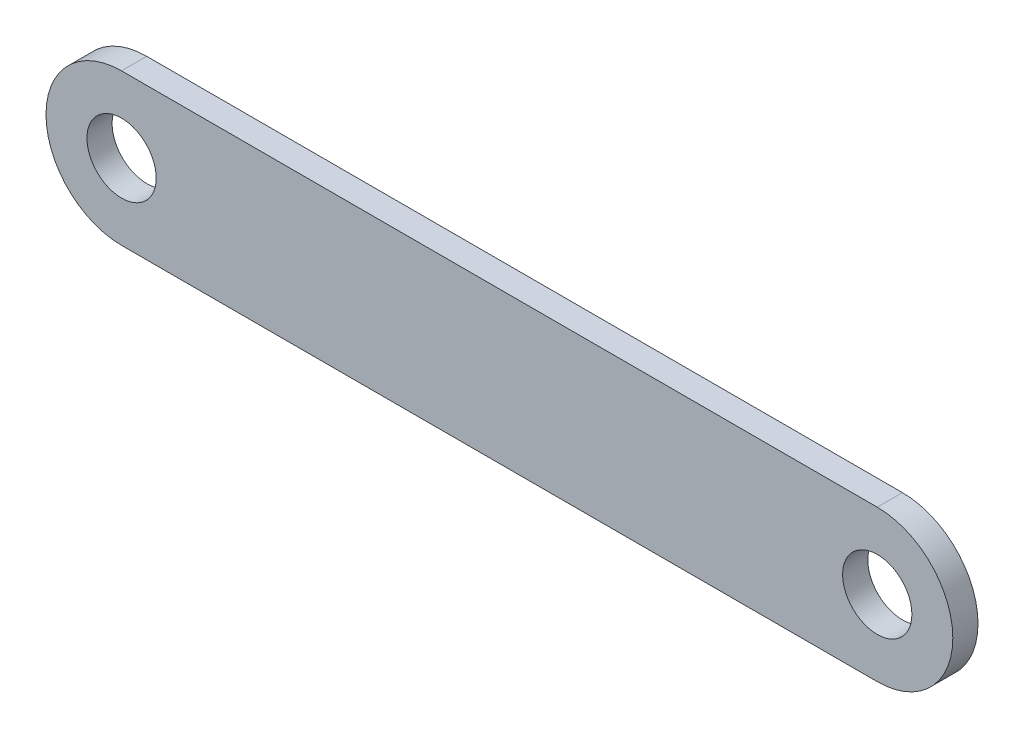
ISO-10303-21;
HEADER;
FILE_DESCRIPTION(('STEP AP214'),'2;1');
FILE_NAME('part.step','',(''),(''),'','','');
FILE_SCHEMA(('AUTOMOTIVE_DESIGN { 1 0 10303 214 1 1 1 1 }'));
ENDSEC;
DATA;
#1=APPLICATION_CONTEXT('core data for automotive mechanical design processes');
#2=APPLICATION_PROTOCOL_DEFINITION('international standard','automotive_design',2000,#1);
#3=PRODUCT_CONTEXT('',#1,'mechanical');
#4=PRODUCT('Part','Part','',(#3));
#5=PRODUCT_RELATED_PRODUCT_CATEGORY('part','',(#4));
#6=PRODUCT_DEFINITION_FORMATION('','',#4);
#7=PRODUCT_DEFINITION_CONTEXT('part definition',#1,'design');
#8=PRODUCT_DEFINITION('design','',#6,#7);
#9=PRODUCT_DEFINITION_SHAPE('','',#8);
#10=(LENGTH_UNIT() NAMED_UNIT(*) SI_UNIT(.MILLI.,.METRE.));
#11=(NAMED_UNIT(*) PLANE_ANGLE_UNIT() SI_UNIT($,.RADIAN.));
#12=(NAMED_UNIT(*) SI_UNIT($,.STERADIAN.) SOLID_ANGLE_UNIT());
#13=UNCERTAINTY_MEASURE_WITH_UNIT(LENGTH_MEASURE(1.E-05),#10,'distance_accuracy_value','');
#14=(GEOMETRIC_REPRESENTATION_CONTEXT(3) GLOBAL_UNCERTAINTY_ASSIGNED_CONTEXT((#13)) GLOBAL_UNIT_ASSIGNED_CONTEXT((#10,
#11,#12)) REPRESENTATION_CONTEXT('',''));
#15=CARTESIAN_POINT('',(0.,0.,0.));
#16=DIRECTION('',(0.,0.,1.));
#17=DIRECTION('',(1.,0.,0.));
#18=AXIS2_PLACEMENT_3D('',#15,#16,#17);
#19=CARTESIAN_POINT('',(-30.,0.,2.));
#20=DIRECTION('',(0.,0.,1.));
#21=DIRECTION('',(1.,0.,0.));
#22=AXIS2_PLACEMENT_3D('',#19,#20,#21);
#23=PLANE('',#22);
#24=CARTESIAN_POINT('',(30.,0.,2.));
#25=DIRECTION('',(0.,0.,1.));
#26=DIRECTION('',(1.,0.,0.));
#27=AXIS2_PLACEMENT_3D('',#24,#25,#26);
#28=CIRCLE('',#27,2.75);
#29=CARTESIAN_POINT('',(32.75,0.,2.));
#30=VERTEX_POINT('',#29);
#31=EDGE_CURVE('E100',#30,#30,#28,.T.);
#32=ORIENTED_EDGE('',*,*,#31,.F.);
#33=EDGE_LOOP('',(#32));
#34=FACE_BOUND('',#33,.T.);
#35=CARTESIAN_POINT('',(-30.,0.,2.));
#36=DIRECTION('',(0.,0.,1.));
#37=DIRECTION('',(1.,0.,0.));
#38=AXIS2_PLACEMENT_3D('',#35,#36,#37);
#39=CIRCLE('',#38,6.);
#40=CARTESIAN_POINT('',(-30.,6.,2.));
#41=VERTEX_POINT('',#40);
#42=CARTESIAN_POINT('',(-30.,-6.,2.));
#43=VERTEX_POINT('',#42);
#44=EDGE_CURVE('E85',#41,#43,#39,.T.);
#45=ORIENTED_EDGE('',*,*,#44,.T.);
#46=DIRECTION('',(1.,0.,0.));
#47=VECTOR('',#46,1.);
#48=CARTESIAN_POINT('',(-30.,-6.,2.));
#49=LINE('',#48,#47);
#50=CARTESIAN_POINT('',(30.,-5.99999999999999,2.));
#51=VERTEX_POINT('',#50);
#52=EDGE_CURVE('E80',#43,#51,#49,.T.);
#53=ORIENTED_EDGE('',*,*,#52,.T.);
#54=CARTESIAN_POINT('',(30.,0.,2.));
#55=DIRECTION('',(0.,0.,1.));
#56=DIRECTION('',(1.,0.,0.));
#57=AXIS2_PLACEMENT_3D('',#54,#55,#56);
#58=CIRCLE('',#57,6.);
#59=CARTESIAN_POINT('',(30.,6.00000000000001,2.));
#60=VERTEX_POINT('',#59);
#61=EDGE_CURVE('E83',#51,#60,#58,.T.);
#62=ORIENTED_EDGE('',*,*,#61,.T.);
#63=DIRECTION('',(-1.,0.,0.));
#64=VECTOR('',#63,1.);
#65=CARTESIAN_POINT('',(-30.,6.,2.));
#66=LINE('',#65,#64);
#67=EDGE_CURVE('E50',#60,#41,#66,.T.);
#68=ORIENTED_EDGE('',*,*,#67,.T.);
#69=EDGE_LOOP('',(#45,#53,#62,#68));
#70=FACE_BOUND('',#69,.T.);
#71=CARTESIAN_POINT('',(-30.,0.,2.));
#72=DIRECTION('',(0.,0.,1.));
#73=DIRECTION('',(1.,0.,0.));
#74=AXIS2_PLACEMENT_3D('',#71,#72,#73);
#75=CIRCLE('',#74,2.75);
#76=CARTESIAN_POINT('',(-27.25,0.,2.));
#77=VERTEX_POINT('',#76);
#78=EDGE_CURVE('E115',#77,#77,#75,.T.);
#79=ORIENTED_EDGE('',*,*,#78,.F.);
#80=EDGE_LOOP('',(#79));
#81=FACE_BOUND('',#80,.T.);
#82=ADVANCED_FACE('F33',(#34,#70,#81),#23,.T.);
#83=CARTESIAN_POINT('',(-30.,0.,0.));
#84=DIRECTION('',(0.,0.,1.));
#85=DIRECTION('',(1.,0.,0.));
#86=AXIS2_PLACEMENT_3D('',#83,#84,#85);
#87=PLANE('',#86);
#88=CARTESIAN_POINT('',(-30.,0.,0.));
#89=DIRECTION('',(0.,0.,1.));
#90=DIRECTION('',(1.,0.,0.));
#91=AXIS2_PLACEMENT_3D('',#88,#89,#90);
#92=CIRCLE('',#91,6.);
#93=CARTESIAN_POINT('',(-30.,6.,0.));
#94=VERTEX_POINT('',#93);
#95=CARTESIAN_POINT('',(-30.,-6.,0.));
#96=VERTEX_POINT('',#95);
#97=EDGE_CURVE('E97',#94,#96,#92,.T.);
#98=ORIENTED_EDGE('',*,*,#97,.F.);
#99=DIRECTION('',(-1.,0.,0.));
#100=VECTOR('',#99,1.);
#101=CARTESIAN_POINT('',(-30.,6.,0.));
#102=LINE('',#101,#100);
#103=CARTESIAN_POINT('',(30.,6.00000000000001,0.));
#104=VERTEX_POINT('',#103);
#105=EDGE_CURVE('E73',#104,#94,#102,.T.);
#106=ORIENTED_EDGE('',*,*,#105,.F.);
#107=CARTESIAN_POINT('',(30.,0.,0.));
#108=DIRECTION('',(0.,0.,1.));
#109=DIRECTION('',(1.,0.,0.));
#110=AXIS2_PLACEMENT_3D('',#107,#108,#109);
#111=CIRCLE('',#110,6.);
#112=CARTESIAN_POINT('',(30.,-5.99999999999999,0.));
#113=VERTEX_POINT('',#112);
#114=EDGE_CURVE('E67',#113,#104,#111,.T.);
#115=ORIENTED_EDGE('',*,*,#114,.F.);
#116=DIRECTION('',(1.,0.,0.));
#117=VECTOR('',#116,1.);
#118=CARTESIAN_POINT('',(-30.,-6.,0.));
#119=LINE('',#118,#117);
#120=EDGE_CURVE('E89',#96,#113,#119,.T.);
#121=ORIENTED_EDGE('',*,*,#120,.F.);
#122=EDGE_LOOP('',(#98,#106,#115,#121));
#123=FACE_BOUND('',#122,.T.);
#124=CARTESIAN_POINT('',(30.,0.,0.));
#125=DIRECTION('',(0.,0.,1.));
#126=DIRECTION('',(1.,0.,0.));
#127=AXIS2_PLACEMENT_3D('',#124,#125,#126);
#128=CIRCLE('',#127,2.75);
#129=CARTESIAN_POINT('',(32.75,0.,0.));
#130=VERTEX_POINT('',#129);
#131=EDGE_CURVE('E112',#130,#130,#128,.T.);
#132=ORIENTED_EDGE('',*,*,#131,.T.);
#133=EDGE_LOOP('',(#132));
#134=FACE_BOUND('',#133,.T.);
#135=CARTESIAN_POINT('',(-30.,0.,0.));
#136=DIRECTION('',(0.,0.,1.));
#137=DIRECTION('',(1.,0.,0.));
#138=AXIS2_PLACEMENT_3D('',#135,#136,#137);
#139=CIRCLE('',#138,2.75);
#140=CARTESIAN_POINT('',(-27.25,0.,0.));
#141=VERTEX_POINT('',#140);
#142=EDGE_CURVE('E118',#141,#141,#139,.T.);
#143=ORIENTED_EDGE('',*,*,#142,.T.);
#144=EDGE_LOOP('',(#143));
#145=FACE_BOUND('',#144,.T.);
#146=ADVANCED_FACE('F108',(#123,#134,#145),#87,.F.);
#147=CARTESIAN_POINT('',(-30.,0.,2.));
#148=DIRECTION('',(0.,0.,-1.));
#149=DIRECTION('',(-1.,0.,0.));
#150=AXIS2_PLACEMENT_3D('',#147,#148,#149);
#151=CYLINDRICAL_SURFACE('',#150,6.);
#152=ORIENTED_EDGE('',*,*,#97,.T.);
#153=DIRECTION('',(0.,0.,-1.));
#154=VECTOR('',#153,1.);
#155=CARTESIAN_POINT('',(-30.,-6.,2.));
#156=LINE('',#155,#154);
#157=EDGE_CURVE('E11',#43,#96,#156,.T.);
#158=ORIENTED_EDGE('',*,*,#157,.F.);
#159=ORIENTED_EDGE('',*,*,#44,.F.);
#160=DIRECTION('',(0.,0.,-1.));
#161=VECTOR('',#160,1.);
#162=CARTESIAN_POINT('',(-30.,6.,2.));
#163=LINE('',#162,#161);
#164=EDGE_CURVE('E93',#41,#94,#163,.T.);
#165=ORIENTED_EDGE('',*,*,#164,.T.);
#166=EDGE_LOOP('',(#152,#158,#159,#165));
#167=FACE_BOUND('',#166,.T.);
#168=ADVANCED_FACE('F35',(#167),#151,.T.);
#169=CARTESIAN_POINT('',(-30.,-6.,2.));
#170=DIRECTION('',(0.,1.,0.));
#171=DIRECTION('',(-1.,0.,0.));
#172=AXIS2_PLACEMENT_3D('',#169,#170,#171);
#173=PLANE('',#172);
#174=ORIENTED_EDGE('',*,*,#120,.T.);
#175=DIRECTION('',(0.,0.,-1.));
#176=VECTOR('',#175,1.);
#177=CARTESIAN_POINT('',(30.,-5.99999999999999,2.));
#178=LINE('',#177,#176);
#179=EDGE_CURVE('E42',#51,#113,#178,.T.);
#180=ORIENTED_EDGE('',*,*,#179,.F.);
#181=ORIENTED_EDGE('',*,*,#52,.F.);
#182=ORIENTED_EDGE('',*,*,#157,.T.);
#183=EDGE_LOOP('',(#174,#180,#181,#182));
#184=FACE_BOUND('',#183,.T.);
#185=ADVANCED_FACE('F88',(#184),#173,.F.);
#186=CARTESIAN_POINT('',(30.,0.,2.));
#187=DIRECTION('',(0.,0.,-1.));
#188=DIRECTION('',(-1.,0.,0.));
#189=AXIS2_PLACEMENT_3D('',#186,#187,#188);
#190=CYLINDRICAL_SURFACE('',#189,6.);
#191=ORIENTED_EDGE('',*,*,#114,.T.);
#192=DIRECTION('',(0.,0.,-1.));
#193=VECTOR('',#192,1.);
#194=CARTESIAN_POINT('',(30.,6.00000000000001,2.));
#195=LINE('',#194,#193);
#196=EDGE_CURVE('E90',#60,#104,#195,.T.);
#197=ORIENTED_EDGE('',*,*,#196,.F.);
#198=ORIENTED_EDGE('',*,*,#61,.F.);
#199=ORIENTED_EDGE('',*,*,#179,.T.);
#200=EDGE_LOOP('',(#191,#197,#198,#199));
#201=FACE_BOUND('',#200,.T.);
#202=ADVANCED_FACE('F91',(#201),#190,.T.);
#203=CARTESIAN_POINT('',(-30.,6.,2.));
#204=DIRECTION('',(0.,-1.,0.));
#205=DIRECTION('',(1.,0.,0.));
#206=AXIS2_PLACEMENT_3D('',#203,#204,#205);
#207=PLANE('',#206);
#208=ORIENTED_EDGE('',*,*,#105,.T.);
#209=ORIENTED_EDGE('',*,*,#164,.F.);
#210=ORIENTED_EDGE('',*,*,#67,.F.);
#211=ORIENTED_EDGE('',*,*,#196,.T.);
#212=EDGE_LOOP('',(#208,#209,#210,#211));
#213=FACE_BOUND('',#212,.T.);
#214=ADVANCED_FACE('F105',(#213),#207,.F.);
#215=CARTESIAN_POINT('',(30.,0.,2.));
#216=DIRECTION('',(0.,0.,-1.));
#217=DIRECTION('',(-1.,0.,0.));
#218=AXIS2_PLACEMENT_3D('',#215,#216,#217);
#219=CYLINDRICAL_SURFACE('',#218,2.75);
#220=ORIENTED_EDGE('',*,*,#31,.T.);
#221=EDGE_LOOP('',(#220));
#222=FACE_BOUND('',#221,.T.);
#223=ORIENTED_EDGE('',*,*,#131,.F.);
#224=EDGE_LOOP('',(#223));
#225=FACE_BOUND('',#224,.T.);
#226=ADVANCED_FACE('F135',(#222,#225),#219,.F.);
#227=CARTESIAN_POINT('',(-30.,0.,2.));
#228=DIRECTION('',(0.,0.,-1.));
#229=DIRECTION('',(-1.,0.,0.));
#230=AXIS2_PLACEMENT_3D('',#227,#228,#229);
#231=CYLINDRICAL_SURFACE('',#230,2.75);
#232=ORIENTED_EDGE('',*,*,#78,.T.);
#233=EDGE_LOOP('',(#232));
#234=FACE_BOUND('',#233,.T.);
#235=ORIENTED_EDGE('',*,*,#142,.F.);
#236=EDGE_LOOP('',(#235));
#237=FACE_BOUND('',#236,.T.);
#238=ADVANCED_FACE('F124',(#234,#237),#231,.F.);
#239=CLOSED_SHELL('',(#82,#146,#168,#185,#202,#214,#226,#238));
#240=MANIFOLD_SOLID_BREP('B2',#239);
#241=ADVANCED_BREP_SHAPE_REPRESENTATION('',(#18,#240),#14);
#242=SHAPE_DEFINITION_REPRESENTATION(#9,#241);
ENDSEC;
END-ISO-10303-21;
